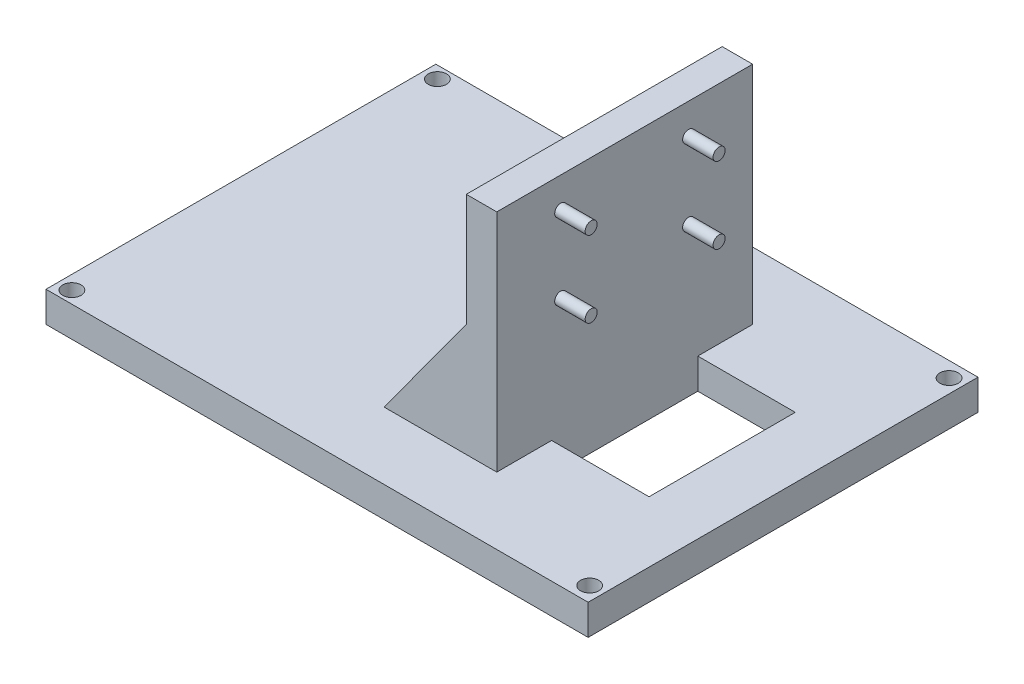
ISO-10303-21;
HEADER;
FILE_DESCRIPTION(('STEP AP214'),'2;1');
FILE_NAME('part.step','',(''),(''),'','','');
FILE_SCHEMA(('AUTOMOTIVE_DESIGN { 1 0 10303 214 1 1 1 1 }'));
ENDSEC;
DATA;
#1=APPLICATION_CONTEXT('core data for automotive mechanical design processes');
#2=APPLICATION_PROTOCOL_DEFINITION('international standard','automotive_design',2000,#1);
#3=PRODUCT_CONTEXT('',#1,'mechanical');
#4=PRODUCT('Part','Part','',(#3));
#5=PRODUCT_RELATED_PRODUCT_CATEGORY('part','',(#4));
#6=PRODUCT_DEFINITION_FORMATION('','',#4);
#7=PRODUCT_DEFINITION_CONTEXT('part definition',#1,'design');
#8=PRODUCT_DEFINITION('design','',#6,#7);
#9=PRODUCT_DEFINITION_SHAPE('','',#8);
#10=(LENGTH_UNIT() NAMED_UNIT(*) SI_UNIT(.MILLI.,.METRE.));
#11=(NAMED_UNIT(*) PLANE_ANGLE_UNIT() SI_UNIT($,.RADIAN.));
#12=(NAMED_UNIT(*) SI_UNIT($,.STERADIAN.) SOLID_ANGLE_UNIT());
#13=UNCERTAINTY_MEASURE_WITH_UNIT(LENGTH_MEASURE(1.E-05),#10,'distance_accuracy_value','');
#14=(GEOMETRIC_REPRESENTATION_CONTEXT(3) GLOBAL_UNCERTAINTY_ASSIGNED_CONTEXT((#13)) GLOBAL_UNIT_ASSIGNED_CONTEXT((#10,
#11,#12)) REPRESENTATION_CONTEXT('',''));
#15=CARTESIAN_POINT('',(0.,0.,0.));
#16=DIRECTION('',(0.,0.,1.));
#17=DIRECTION('',(1.,0.,0.));
#18=AXIS2_PLACEMENT_3D('',#15,#16,#17);
#19=CARTESIAN_POINT('',(0.,5.,0.));
#20=DIRECTION('',(0.,1.,0.));
#21=DIRECTION('',(0.,0.,1.));
#22=AXIS2_PLACEMENT_3D('',#19,#20,#21);
#23=PLANE('',#22);
#24=DIRECTION('',(-1.,0.,0.));
#25=VECTOR('',#24,1.);
#26=CARTESIAN_POINT('',(34.5,5.,12.));
#27=LINE('',#26,#25);
#28=CARTESIAN_POINT('',(34.5,5.,12.));
#29=VERTEX_POINT('',#28);
#30=CARTESIAN_POINT('',(18.5,5.,12.));
#31=VERTEX_POINT('',#30);
#32=EDGE_CURVE('E199',#29,#31,#27,.T.);
#33=ORIENTED_EDGE('',*,*,#32,.T.);
#34=DIRECTION('',(0.,0.,-1.));
#35=VECTOR('',#34,1.);
#36=CARTESIAN_POINT('',(18.5,5.,0.));
#37=LINE('',#36,#35);
#38=CARTESIAN_POINT('',(18.5,5.,21.));
#39=VERTEX_POINT('',#38);
#40=EDGE_CURVE('E56',#39,#31,#37,.T.);
#41=ORIENTED_EDGE('',*,*,#40,.F.);
#42=DIRECTION('',(1.,0.,0.));
#43=VECTOR('',#42,1.);
#44=CARTESIAN_POINT('',(0.,5.,21.));
#45=LINE('',#44,#43);
#46=CARTESIAN_POINT('',(0.,5.,21.));
#47=VERTEX_POINT('',#46);
#48=EDGE_CURVE('E191',#47,#39,#45,.T.);
#49=ORIENTED_EDGE('',*,*,#48,.F.);
#50=DIRECTION('',(0.,0.,-1.));
#51=VECTOR('',#50,1.);
#52=CARTESIAN_POINT('',(0.,5.,21.));
#53=LINE('',#52,#51);
#54=CARTESIAN_POINT('',(0.,5.,-21.));
#55=VERTEX_POINT('',#54);
#56=EDGE_CURVE('E159',#47,#55,#53,.T.);
#57=ORIENTED_EDGE('',*,*,#56,.T.);
#58=DIRECTION('',(1.,0.,0.));
#59=VECTOR('',#58,1.);
#60=CARTESIAN_POINT('',(0.,5.,-21.));
#61=LINE('',#60,#59);
#62=CARTESIAN_POINT('',(18.5,5.00000000000001,-21.));
#63=VERTEX_POINT('',#62);
#64=EDGE_CURVE('E193',#55,#63,#61,.T.);
#65=ORIENTED_EDGE('',*,*,#64,.T.);
#66=CARTESIAN_POINT('',(18.5,5.,-12.));
#67=VERTEX_POINT('',#66);
#68=EDGE_CURVE('E189',#67,#63,#37,.T.);
#69=ORIENTED_EDGE('',*,*,#68,.F.);
#70=DIRECTION('',(-1.,0.,0.));
#71=VECTOR('',#70,1.);
#72=CARTESIAN_POINT('',(34.5,5.,-12.));
#73=LINE('',#72,#71);
#74=CARTESIAN_POINT('',(34.5,5.,-12.));
#75=VERTEX_POINT('',#74);
#76=EDGE_CURVE('E48',#75,#67,#73,.T.);
#77=ORIENTED_EDGE('',*,*,#76,.F.);
#78=DIRECTION('',(0.,0.,1.));
#79=VECTOR('',#78,1.);
#80=CARTESIAN_POINT('',(34.5,5.,-12.));
#81=LINE('',#80,#79);
#82=EDGE_CURVE('E196',#75,#29,#81,.T.);
#83=ORIENTED_EDGE('',*,*,#82,.T.);
#84=EDGE_LOOP('',(#33,#41,#49,#57,#65,#69,#77,#83));
#85=FACE_BOUND('',#84,.T.);
#86=CARTESIAN_POINT('',(-42.25,5.,30.));
#87=DIRECTION('',(0.,1.,0.));
#88=DIRECTION('',(0.,0.,1.));
#89=AXIS2_PLACEMENT_3D('',#86,#87,#88);
#90=CIRCLE('',#89,1.5);
#91=CARTESIAN_POINT('',(-42.25,5.,31.5));
#92=VERTEX_POINT('',#91);
#93=EDGE_CURVE('E208',#92,#92,#90,.T.);
#94=ORIENTED_EDGE('',*,*,#93,.F.);
#95=EDGE_LOOP('',(#94));
#96=FACE_BOUND('',#95,.T.);
#97=CARTESIAN_POINT('',(-42.25,5.,-30.));
#98=DIRECTION('',(0.,1.,0.));
#99=DIRECTION('',(0.,0.,1.));
#100=AXIS2_PLACEMENT_3D('',#97,#98,#99);
#101=CIRCLE('',#100,1.5);
#102=CARTESIAN_POINT('',(-42.25,5.,-28.5));
#103=VERTEX_POINT('',#102);
#104=EDGE_CURVE('E211',#103,#103,#101,.T.);
#105=ORIENTED_EDGE('',*,*,#104,.F.);
#106=EDGE_LOOP('',(#105));
#107=FACE_BOUND('',#106,.T.);
#108=CARTESIAN_POINT('',(42.25,5.,-29.5));
#109=DIRECTION('',(0.,1.,0.));
#110=DIRECTION('',(0.,0.,1.));
#111=AXIS2_PLACEMENT_3D('',#108,#109,#110);
#112=CIRCLE('',#111,1.5);
#113=CARTESIAN_POINT('',(42.25,5.,-28.));
#114=VERTEX_POINT('',#113);
#115=EDGE_CURVE('E215',#114,#114,#112,.T.);
#116=ORIENTED_EDGE('',*,*,#115,.F.);
#117=EDGE_LOOP('',(#116));
#118=FACE_BOUND('',#117,.T.);
#119=CARTESIAN_POINT('',(42.25,5.,29.5));
#120=DIRECTION('',(0.,1.,0.));
#121=DIRECTION('',(0.,0.,1.));
#122=AXIS2_PLACEMENT_3D('',#119,#120,#121);
#123=CIRCLE('',#122,1.5);
#124=CARTESIAN_POINT('',(42.25,5.,31.));
#125=VERTEX_POINT('',#124);
#126=EDGE_CURVE('E218',#125,#125,#123,.T.);
#127=ORIENTED_EDGE('',*,*,#126,.F.);
#128=EDGE_LOOP('',(#127));
#129=FACE_BOUND('',#128,.T.);
#130=DIRECTION('',(0.,0.,-1.));
#131=VECTOR('',#130,1.);
#132=CARTESIAN_POINT('',(-44.5,5.,0.));
#133=LINE('',#132,#131);
#134=CARTESIAN_POINT('',(-44.5,5.,32.));
#135=VERTEX_POINT('',#134);
#136=CARTESIAN_POINT('',(-44.5,5.,-32.));
#137=VERTEX_POINT('',#136);
#138=EDGE_CURVE('E221',#135,#137,#133,.T.);
#139=ORIENTED_EDGE('',*,*,#138,.F.);
#140=DIRECTION('',(-1.,0.,0.));
#141=VECTOR('',#140,1.);
#142=CARTESIAN_POINT('',(0.,5.,32.));
#143=LINE('',#142,#141);
#144=CARTESIAN_POINT('',(44.5,5.,32.));
#145=VERTEX_POINT('',#144);
#146=EDGE_CURVE('E224',#145,#135,#143,.T.);
#147=ORIENTED_EDGE('',*,*,#146,.F.);
#148=DIRECTION('',(0.,0.,-1.));
#149=VECTOR('',#148,1.);
#150=CARTESIAN_POINT('',(44.5,5.,0.));
#151=LINE('',#150,#149);
#152=CARTESIAN_POINT('',(44.5,5.,-32.));
#153=VERTEX_POINT('',#152);
#154=EDGE_CURVE('E227',#145,#153,#151,.T.);
#155=ORIENTED_EDGE('',*,*,#154,.T.);
#156=DIRECTION('',(-1.,0.,0.));
#157=VECTOR('',#156,1.);
#158=CARTESIAN_POINT('',(0.,5.,-32.));
#159=LINE('',#158,#157);
#160=EDGE_CURVE('E230',#153,#137,#159,.T.);
#161=ORIENTED_EDGE('',*,*,#160,.T.);
#162=EDGE_LOOP('',(#139,#147,#155,#161));
#163=FACE_BOUND('',#162,.T.);
#164=ADVANCED_FACE('F33',(#85,#96,#107,#118,#129,#163),#23,.T.);
#165=CARTESIAN_POINT('',(13.5,42.,-21.));
#166=DIRECTION('',(1.,0.,0.));
#167=DIRECTION('',(0.,0.,-1.));
#168=AXIS2_PLACEMENT_3D('',#165,#166,#167);
#169=PLANE('',#168);
#170=DIRECTION('',(0.,0.,-1.));
#171=VECTOR('',#170,1.);
#172=CARTESIAN_POINT('',(13.5,23.5,21.));
#173=LINE('',#172,#171);
#174=CARTESIAN_POINT('',(13.5,23.5,21.));
#175=VERTEX_POINT('',#174);
#176=CARTESIAN_POINT('',(13.5,23.5,-21.));
#177=VERTEX_POINT('',#176);
#178=EDGE_CURVE('E164',#175,#177,#173,.T.);
#179=ORIENTED_EDGE('',*,*,#178,.F.);
#180=DIRECTION('',(0.,-1.,0.));
#181=VECTOR('',#180,1.);
#182=CARTESIAN_POINT('',(13.5,42.,21.));
#183=LINE('',#182,#181);
#184=CARTESIAN_POINT('',(13.5,42.,21.));
#185=VERTEX_POINT('',#184);
#186=EDGE_CURVE('E183',#185,#175,#183,.T.);
#187=ORIENTED_EDGE('',*,*,#186,.F.);
#188=DIRECTION('',(0.,0.,1.));
#189=VECTOR('',#188,1.);
#190=CARTESIAN_POINT('',(13.5,42.,-21.));
#191=LINE('',#190,#189);
#192=CARTESIAN_POINT('',(13.5,42.,-21.));
#193=VERTEX_POINT('',#192);
#194=EDGE_CURVE('E170',#193,#185,#191,.T.);
#195=ORIENTED_EDGE('',*,*,#194,.F.);
#196=DIRECTION('',(0.,-1.,0.));
#197=VECTOR('',#196,1.);
#198=CARTESIAN_POINT('',(13.5,42.,-21.));
#199=LINE('',#198,#197);
#200=EDGE_CURVE('E186',#193,#177,#199,.T.);
#201=ORIENTED_EDGE('',*,*,#200,.T.);
#202=EDGE_LOOP('',(#179,#187,#195,#201));
#203=FACE_BOUND('',#202,.T.);
#204=ADVANCED_FACE('F278',(#203),#169,.F.);
#205=CARTESIAN_POINT('',(-44.5,5.,0.));
#206=DIRECTION('',(-1.,0.,0.));
#207=DIRECTION('',(0.,0.,1.));
#208=AXIS2_PLACEMENT_3D('',#205,#206,#207);
#209=PLANE('',#208);
#210=DIRECTION('',(0.,0.,-1.));
#211=VECTOR('',#210,1.);
#212=CARTESIAN_POINT('',(-44.5,0.,0.));
#213=LINE('',#212,#211);
#214=CARTESIAN_POINT('',(-44.5,0.,32.));
#215=VERTEX_POINT('',#214);
#216=CARTESIAN_POINT('',(-44.5,0.,-32.));
#217=VERTEX_POINT('',#216);
#218=EDGE_CURVE('E244',#215,#217,#213,.T.);
#219=ORIENTED_EDGE('',*,*,#218,.F.);
#220=DIRECTION('',(0.,-1.,0.));
#221=VECTOR('',#220,1.);
#222=CARTESIAN_POINT('',(-44.5,5.,32.));
#223=LINE('',#222,#221);
#224=EDGE_CURVE('E11',#135,#215,#223,.T.);
#225=ORIENTED_EDGE('',*,*,#224,.F.);
#226=ORIENTED_EDGE('',*,*,#138,.T.);
#227=DIRECTION('',(0.,-1.,0.));
#228=VECTOR('',#227,1.);
#229=CARTESIAN_POINT('',(-44.5,5.,-32.));
#230=LINE('',#229,#228);
#231=EDGE_CURVE('E232',#137,#217,#230,.T.);
#232=ORIENTED_EDGE('',*,*,#231,.T.);
#233=EDGE_LOOP('',(#219,#225,#226,#232));
#234=FACE_BOUND('',#233,.T.);
#235=ADVANCED_FACE('F272',(#234),#209,.T.);
#236=CARTESIAN_POINT('',(0.,5.,32.));
#237=DIRECTION('',(0.,0.,1.));
#238=DIRECTION('',(1.,0.,0.));
#239=AXIS2_PLACEMENT_3D('',#236,#237,#238);
#240=PLANE('',#239);
#241=DIRECTION('',(-1.,0.,0.));
#242=VECTOR('',#241,1.);
#243=CARTESIAN_POINT('',(0.,0.,32.));
#244=LINE('',#243,#242);
#245=CARTESIAN_POINT('',(44.5,0.,32.));
#246=VERTEX_POINT('',#245);
#247=EDGE_CURVE('E247',#246,#215,#244,.T.);
#248=ORIENTED_EDGE('',*,*,#247,.F.);
#249=DIRECTION('',(0.,-1.,0.));
#250=VECTOR('',#249,1.);
#251=CARTESIAN_POINT('',(44.5,5.,32.));
#252=LINE('',#251,#250);
#253=EDGE_CURVE('E41',#145,#246,#252,.T.);
#254=ORIENTED_EDGE('',*,*,#253,.F.);
#255=ORIENTED_EDGE('',*,*,#146,.T.);
#256=ORIENTED_EDGE('',*,*,#224,.T.);
#257=EDGE_LOOP('',(#248,#254,#255,#256));
#258=FACE_BOUND('',#257,.T.);
#259=ADVANCED_FACE('F268',(#258),#240,.T.);
#260=CARTESIAN_POINT('',(44.5,5.,0.));
#261=DIRECTION('',(-1.,0.,0.));
#262=DIRECTION('',(0.,0.,1.));
#263=AXIS2_PLACEMENT_3D('',#260,#261,#262);
#264=PLANE('',#263);
#265=DIRECTION('',(0.,0.,-1.));
#266=VECTOR('',#265,1.);
#267=CARTESIAN_POINT('',(44.5,0.,0.));
#268=LINE('',#267,#266);
#269=CARTESIAN_POINT('',(44.5,0.,-32.));
#270=VERTEX_POINT('',#269);
#271=EDGE_CURVE('E250',#246,#270,#268,.T.);
#272=ORIENTED_EDGE('',*,*,#271,.T.);
#273=DIRECTION('',(0.,-1.,0.));
#274=VECTOR('',#273,1.);
#275=CARTESIAN_POINT('',(44.5,5.,-32.));
#276=LINE('',#275,#274);
#277=EDGE_CURVE('E256',#153,#270,#276,.T.);
#278=ORIENTED_EDGE('',*,*,#277,.F.);
#279=ORIENTED_EDGE('',*,*,#154,.F.);
#280=ORIENTED_EDGE('',*,*,#253,.T.);
#281=EDGE_LOOP('',(#272,#278,#279,#280));
#282=FACE_BOUND('',#281,.T.);
#283=ADVANCED_FACE('F261',(#282),#264,.F.);
#284=CARTESIAN_POINT('',(42.25,5.,29.5));
#285=DIRECTION('',(0.,-1.,0.));
#286=DIRECTION('',(0.,0.,-1.));
#287=AXIS2_PLACEMENT_3D('',#284,#285,#286);
#288=CYLINDRICAL_SURFACE('',#287,1.5);
#289=ORIENTED_EDGE('',*,*,#126,.T.);
#290=EDGE_LOOP('',(#289));
#291=FACE_BOUND('',#290,.T.);
#292=CARTESIAN_POINT('',(42.25,0.,29.5));
#293=DIRECTION('',(0.,1.,0.));
#294=DIRECTION('',(0.,0.,1.));
#295=AXIS2_PLACEMENT_3D('',#292,#293,#294);
#296=CIRCLE('',#295,1.5);
#297=CARTESIAN_POINT('',(42.25,0.,31.));
#298=VERTEX_POINT('',#297);
#299=EDGE_CURVE('E241',#298,#298,#296,.T.);
#300=ORIENTED_EDGE('',*,*,#299,.F.);
#301=EDGE_LOOP('',(#300));
#302=FACE_BOUND('',#301,.T.);
#303=ADVANCED_FACE('F296',(#291,#302),#288,.F.);
#304=CARTESIAN_POINT('',(42.25,5.,-29.5));
#305=DIRECTION('',(0.,-1.,0.));
#306=DIRECTION('',(0.,0.,-1.));
#307=AXIS2_PLACEMENT_3D('',#304,#305,#306);
#308=CYLINDRICAL_SURFACE('',#307,1.5);
#309=ORIENTED_EDGE('',*,*,#115,.T.);
#310=EDGE_LOOP('',(#309));
#311=FACE_BOUND('',#310,.T.);
#312=CARTESIAN_POINT('',(42.25,0.,-29.5));
#313=DIRECTION('',(0.,1.,0.));
#314=DIRECTION('',(0.,0.,1.));
#315=AXIS2_PLACEMENT_3D('',#312,#313,#314);
#316=CIRCLE('',#315,1.5);
#317=CARTESIAN_POINT('',(42.25,0.,-28.));
#318=VERTEX_POINT('',#317);
#319=EDGE_CURVE('E238',#318,#318,#316,.T.);
#320=ORIENTED_EDGE('',*,*,#319,.F.);
#321=EDGE_LOOP('',(#320));
#322=FACE_BOUND('',#321,.T.);
#323=ADVANCED_FACE('F303',(#311,#322),#308,.F.);
#324=CARTESIAN_POINT('',(-42.25,5.,-30.));
#325=DIRECTION('',(0.,-1.,0.));
#326=DIRECTION('',(0.,0.,-1.));
#327=AXIS2_PLACEMENT_3D('',#324,#325,#326);
#328=CYLINDRICAL_SURFACE('',#327,1.5);
#329=ORIENTED_EDGE('',*,*,#104,.T.);
#330=EDGE_LOOP('',(#329));
#331=FACE_BOUND('',#330,.T.);
#332=CARTESIAN_POINT('',(-42.25,0.,-30.));
#333=DIRECTION('',(0.,1.,0.));
#334=DIRECTION('',(0.,0.,1.));
#335=AXIS2_PLACEMENT_3D('',#332,#333,#334);
#336=CIRCLE('',#335,1.5);
#337=CARTESIAN_POINT('',(-42.25,0.,-28.5));
#338=VERTEX_POINT('',#337);
#339=EDGE_CURVE('E235',#338,#338,#336,.T.);
#340=ORIENTED_EDGE('',*,*,#339,.F.);
#341=EDGE_LOOP('',(#340));
#342=FACE_BOUND('',#341,.T.);
#343=ADVANCED_FACE('F306',(#331,#342),#328,.F.);
#344=CARTESIAN_POINT('',(-42.25,5.,30.));
#345=DIRECTION('',(0.,-1.,0.));
#346=DIRECTION('',(0.,0.,-1.));
#347=AXIS2_PLACEMENT_3D('',#344,#345,#346);
#348=CYLINDRICAL_SURFACE('',#347,1.5);
#349=ORIENTED_EDGE('',*,*,#93,.T.);
#350=EDGE_LOOP('',(#349));
#351=FACE_BOUND('',#350,.T.);
#352=CARTESIAN_POINT('',(-42.25,0.,30.));
#353=DIRECTION('',(0.,1.,0.));
#354=DIRECTION('',(0.,0.,1.));
#355=AXIS2_PLACEMENT_3D('',#352,#353,#354);
#356=CIRCLE('',#355,1.5);
#357=CARTESIAN_POINT('',(-42.25,0.,31.5));
#358=VERTEX_POINT('',#357);
#359=EDGE_CURVE('E206',#358,#358,#356,.T.);
#360=ORIENTED_EDGE('',*,*,#359,.F.);
#361=EDGE_LOOP('',(#360));
#362=FACE_BOUND('',#361,.T.);
#363=ADVANCED_FACE('F35',(#351,#362),#348,.F.);
#364=CARTESIAN_POINT('',(0.,5.,-32.));
#365=DIRECTION('',(0.,0.,1.));
#366=DIRECTION('',(1.,0.,0.));
#367=AXIS2_PLACEMENT_3D('',#364,#365,#366);
#368=PLANE('',#367);
#369=DIRECTION('',(-1.,0.,0.));
#370=VECTOR('',#369,1.);
#371=CARTESIAN_POINT('',(0.,0.,-32.));
#372=LINE('',#371,#370);
#373=EDGE_CURVE('E212',#270,#217,#372,.T.);
#374=ORIENTED_EDGE('',*,*,#373,.T.);
#375=ORIENTED_EDGE('',*,*,#231,.F.);
#376=ORIENTED_EDGE('',*,*,#160,.F.);
#377=ORIENTED_EDGE('',*,*,#277,.T.);
#378=EDGE_LOOP('',(#374,#375,#376,#377));
#379=FACE_BOUND('',#378,.T.);
#380=ADVANCED_FACE('F275',(#379),#368,.F.);
#381=CARTESIAN_POINT('',(0.,0.,0.));
#382=DIRECTION('',(0.,1.,0.));
#383=DIRECTION('',(0.,0.,1.));
#384=AXIS2_PLACEMENT_3D('',#381,#382,#383);
#385=PLANE('',#384);
#386=ORIENTED_EDGE('',*,*,#218,.T.);
#387=ORIENTED_EDGE('',*,*,#373,.F.);
#388=ORIENTED_EDGE('',*,*,#271,.F.);
#389=ORIENTED_EDGE('',*,*,#247,.T.);
#390=EDGE_LOOP('',(#386,#387,#388,#389));
#391=FACE_BOUND('',#390,.T.);
#392=ORIENTED_EDGE('',*,*,#299,.T.);
#393=EDGE_LOOP('',(#392));
#394=FACE_BOUND('',#393,.T.);
#395=ORIENTED_EDGE('',*,*,#319,.T.);
#396=EDGE_LOOP('',(#395));
#397=FACE_BOUND('',#396,.T.);
#398=ORIENTED_EDGE('',*,*,#339,.T.);
#399=EDGE_LOOP('',(#398));
#400=FACE_BOUND('',#399,.T.);
#401=ORIENTED_EDGE('',*,*,#359,.T.);
#402=EDGE_LOOP('',(#401));
#403=FACE_BOUND('',#402,.T.);
#404=DIRECTION('',(0.,0.,-1.));
#405=VECTOR('',#404,1.);
#406=CARTESIAN_POINT('',(18.5,0.,12.));
#407=LINE('',#406,#405);
#408=CARTESIAN_POINT('',(18.5,0.,12.));
#409=VERTEX_POINT('',#408);
#410=CARTESIAN_POINT('',(18.5,0.,-12.));
#411=VERTEX_POINT('',#410);
#412=EDGE_CURVE('E145',#409,#411,#407,.T.);
#413=ORIENTED_EDGE('',*,*,#412,.F.);
#414=DIRECTION('',(-1.,0.,0.));
#415=VECTOR('',#414,1.);
#416=CARTESIAN_POINT('',(34.5,0.,12.));
#417=LINE('',#416,#415);
#418=CARTESIAN_POINT('',(34.5,0.,12.));
#419=VERTEX_POINT('',#418);
#420=EDGE_CURVE('E129',#419,#409,#417,.T.);
#421=ORIENTED_EDGE('',*,*,#420,.F.);
#422=DIRECTION('',(0.,0.,1.));
#423=VECTOR('',#422,1.);
#424=CARTESIAN_POINT('',(34.5,0.,-12.));
#425=LINE('',#424,#423);
#426=CARTESIAN_POINT('',(34.5,0.,-12.));
#427=VERTEX_POINT('',#426);
#428=EDGE_CURVE('E139',#427,#419,#425,.T.);
#429=ORIENTED_EDGE('',*,*,#428,.F.);
#430=DIRECTION('',(-1.,0.,0.));
#431=VECTOR('',#430,1.);
#432=CARTESIAN_POINT('',(34.5,0.,-12.));
#433=LINE('',#432,#431);
#434=EDGE_CURVE('E138',#427,#411,#433,.T.);
#435=ORIENTED_EDGE('',*,*,#434,.T.);
#436=EDGE_LOOP('',(#413,#421,#429,#435));
#437=FACE_BOUND('',#436,.T.);
#438=ADVANCED_FACE('F148',(#391,#394,#397,#400,#403,#437),#385,.F.);
#439=CARTESIAN_POINT('',(34.5,5.,-12.));
#440=DIRECTION('',(1.,0.,0.));
#441=DIRECTION('',(0.,0.,-1.));
#442=AXIS2_PLACEMENT_3D('',#439,#440,#441);
#443=PLANE('',#442);
#444=ORIENTED_EDGE('',*,*,#428,.T.);
#445=DIRECTION('',(0.,-1.,0.));
#446=VECTOR('',#445,1.);
#447=CARTESIAN_POINT('',(34.5,5.,12.));
#448=LINE('',#447,#446);
#449=EDGE_CURVE('E134',#29,#419,#448,.T.);
#450=ORIENTED_EDGE('',*,*,#449,.F.);
#451=ORIENTED_EDGE('',*,*,#82,.F.);
#452=DIRECTION('',(0.,-1.,0.));
#453=VECTOR('',#452,1.);
#454=CARTESIAN_POINT('',(34.5,5.,-12.));
#455=LINE('',#454,#453);
#456=EDGE_CURVE('E204',#75,#427,#455,.T.);
#457=ORIENTED_EDGE('',*,*,#456,.T.);
#458=EDGE_LOOP('',(#444,#450,#451,#457));
#459=FACE_BOUND('',#458,.T.);
#460=ADVANCED_FACE('F288',(#459),#443,.F.);
#461=CARTESIAN_POINT('',(34.5,5.,-12.));
#462=DIRECTION('',(0.,0.,1.));
#463=DIRECTION('',(1.,0.,0.));
#464=AXIS2_PLACEMENT_3D('',#461,#462,#463);
#465=PLANE('',#464);
#466=ORIENTED_EDGE('',*,*,#434,.F.);
#467=ORIENTED_EDGE('',*,*,#456,.F.);
#468=ORIENTED_EDGE('',*,*,#76,.T.);
#469=DIRECTION('',(0.,1.,0.));
#470=VECTOR('',#469,1.);
#471=CARTESIAN_POINT('',(18.5,5.,-12.));
#472=LINE('',#471,#470);
#473=EDGE_CURVE('E150',#411,#67,#472,.T.);
#474=ORIENTED_EDGE('',*,*,#473,.F.);
#475=EDGE_LOOP('',(#466,#467,#468,#474));
#476=FACE_BOUND('',#475,.T.);
#477=ADVANCED_FACE('F349',(#476),#465,.T.);
#478=CARTESIAN_POINT('',(34.5,5.,12.));
#479=DIRECTION('',(0.,0.,1.));
#480=DIRECTION('',(1.,0.,0.));
#481=AXIS2_PLACEMENT_3D('',#478,#479,#480);
#482=PLANE('',#481);
#483=ORIENTED_EDGE('',*,*,#420,.T.);
#484=DIRECTION('',(0.,-1.,0.));
#485=VECTOR('',#484,1.);
#486=CARTESIAN_POINT('',(18.5,5.,12.));
#487=LINE('',#486,#485);
#488=EDGE_CURVE('E133',#31,#409,#487,.T.);
#489=ORIENTED_EDGE('',*,*,#488,.F.);
#490=ORIENTED_EDGE('',*,*,#32,.F.);
#491=ORIENTED_EDGE('',*,*,#449,.T.);
#492=EDGE_LOOP('',(#483,#489,#490,#491));
#493=FACE_BOUND('',#492,.T.);
#494=ADVANCED_FACE('F131',(#493),#482,.F.);
#495=CARTESIAN_POINT('',(18.5,42.,-21.));
#496=DIRECTION('',(0.,0.,1.));
#497=DIRECTION('',(1.,0.,0.));
#498=AXIS2_PLACEMENT_3D('',#495,#496,#497);
#499=PLANE('',#498);
#500=ORIENTED_EDGE('',*,*,#64,.F.);
#501=DIRECTION('',(-0.589469070059423,-0.807790947859209,0.));
#502=VECTOR('',#501,1.);
#503=CARTESIAN_POINT('',(13.5,23.5,-21.));
#504=LINE('',#503,#502);
#505=EDGE_CURVE('E152',#177,#55,#504,.T.);
#506=ORIENTED_EDGE('',*,*,#505,.F.);
#507=ORIENTED_EDGE('',*,*,#200,.F.);
#508=DIRECTION('',(-1.,0.,0.));
#509=VECTOR('',#508,1.);
#510=CARTESIAN_POINT('',(18.5,42.,-21.));
#511=LINE('',#510,#509);
#512=CARTESIAN_POINT('',(18.5,42.,-21.));
#513=VERTEX_POINT('',#512);
#514=EDGE_CURVE('E167',#513,#193,#511,.T.);
#515=ORIENTED_EDGE('',*,*,#514,.F.);
#516=DIRECTION('',(0.,-1.,0.));
#517=VECTOR('',#516,1.);
#518=CARTESIAN_POINT('',(18.5,42.,-21.));
#519=LINE('',#518,#517);
#520=EDGE_CURVE('E178',#513,#63,#519,.T.);
#521=ORIENTED_EDGE('',*,*,#520,.T.);
#522=EDGE_LOOP('',(#500,#506,#507,#515,#521));
#523=FACE_BOUND('',#522,.T.);
#524=ADVANCED_FACE('F362',(#523),#499,.F.);
#525=CARTESIAN_POINT('',(18.5,42.,21.));
#526=DIRECTION('',(0.,0.,1.));
#527=DIRECTION('',(1.,0.,0.));
#528=AXIS2_PLACEMENT_3D('',#525,#526,#527);
#529=PLANE('',#528);
#530=ORIENTED_EDGE('',*,*,#186,.T.);
#531=DIRECTION('',(-0.589469070059423,-0.807790947859209,0.));
#532=VECTOR('',#531,1.);
#533=CARTESIAN_POINT('',(13.5,23.5,21.));
#534=LINE('',#533,#532);
#535=EDGE_CURVE('E156',#175,#47,#534,.T.);
#536=ORIENTED_EDGE('',*,*,#535,.T.);
#537=ORIENTED_EDGE('',*,*,#48,.T.);
#538=DIRECTION('',(0.,-1.,0.));
#539=VECTOR('',#538,1.);
#540=CARTESIAN_POINT('',(18.5,42.,21.));
#541=LINE('',#540,#539);
#542=CARTESIAN_POINT('',(18.5,42.,21.));
#543=VERTEX_POINT('',#542);
#544=EDGE_CURVE('E181',#543,#39,#541,.T.);
#545=ORIENTED_EDGE('',*,*,#544,.F.);
#546=DIRECTION('',(-1.,0.,0.));
#547=VECTOR('',#546,1.);
#548=CARTESIAN_POINT('',(18.5,42.,21.));
#549=LINE('',#548,#547);
#550=EDGE_CURVE('E172',#543,#185,#549,.T.);
#551=ORIENTED_EDGE('',*,*,#550,.T.);
#552=EDGE_LOOP('',(#530,#536,#537,#545,#551));
#553=FACE_BOUND('',#552,.T.);
#554=ADVANCED_FACE('F369',(#553),#529,.T.);
#555=CARTESIAN_POINT('',(18.5,42.,-21.));
#556=DIRECTION('',(1.,0.,0.));
#557=DIRECTION('',(0.,0.,-1.));
#558=AXIS2_PLACEMENT_3D('',#555,#556,#557);
#559=PLANE('',#558);
#560=CARTESIAN_POINT('',(18.5,24.5,10.4999999999999));
#561=DIRECTION('',(1.,0.,0.));
#562=DIRECTION('',(0.,0.,-1.));
#563=AXIS2_PLACEMENT_3D('',#560,#561,#562);
#564=CIRCLE('',#563,0.989999999999999);
#565=CARTESIAN_POINT('',(18.5,24.5,9.50999999999988));
#566=VERTEX_POINT('',#565);
#567=EDGE_CURVE('E569',#566,#566,#564,.T.);
#568=ORIENTED_EDGE('',*,*,#567,.F.);
#569=EDGE_LOOP('',(#568));
#570=FACE_BOUND('',#569,.T.);
#571=CARTESIAN_POINT('',(18.5,24.5000000000002,-10.5000000000001));
#572=DIRECTION('',(1.,0.,0.));
#573=DIRECTION('',(0.,0.,-1.));
#574=AXIS2_PLACEMENT_3D('',#571,#572,#573);
#575=CIRCLE('',#574,0.989999999999999);
#576=CARTESIAN_POINT('',(18.5,24.5000000000002,-11.4900000000001));
#577=VERTEX_POINT('',#576);
#578=EDGE_CURVE('E568',#577,#577,#575,.T.);
#579=ORIENTED_EDGE('',*,*,#578,.F.);
#580=EDGE_LOOP('',(#579));
#581=FACE_BOUND('',#580,.T.);
#582=CARTESIAN_POINT('',(18.5,37.,-10.5));
#583=DIRECTION('',(1.,0.,0.));
#584=DIRECTION('',(0.,0.,-1.));
#585=AXIS2_PLACEMENT_3D('',#582,#583,#584);
#586=CIRCLE('',#585,0.989999999999999);
#587=CARTESIAN_POINT('',(18.5,37.,-11.49));
#588=VERTEX_POINT('',#587);
#589=EDGE_CURVE('E578',#588,#588,#586,.T.);
#590=ORIENTED_EDGE('',*,*,#589,.F.);
#591=EDGE_LOOP('',(#590));
#592=FACE_BOUND('',#591,.T.);
#593=CARTESIAN_POINT('',(18.5,37.,10.4999999999999));
#594=DIRECTION('',(1.,0.,0.));
#595=DIRECTION('',(0.,0.,-1.));
#596=AXIS2_PLACEMENT_3D('',#593,#594,#595);
#597=CIRCLE('',#596,0.990000000000003);
#598=CARTESIAN_POINT('',(18.5,37.,9.50999999999994));
#599=VERTEX_POINT('',#598);
#600=EDGE_CURVE('E583',#599,#599,#597,.T.);
#601=ORIENTED_EDGE('',*,*,#600,.F.);
#602=EDGE_LOOP('',(#601));
#603=FACE_BOUND('',#602,.T.);
#604=ORIENTED_EDGE('',*,*,#544,.T.);
#605=ORIENTED_EDGE('',*,*,#40,.T.);
#606=ORIENTED_EDGE('',*,*,#488,.T.);
#607=ORIENTED_EDGE('',*,*,#412,.T.);
#608=ORIENTED_EDGE('',*,*,#473,.T.);
#609=ORIENTED_EDGE('',*,*,#68,.T.);
#610=ORIENTED_EDGE('',*,*,#520,.F.);
#611=DIRECTION('',(0.,0.,1.));
#612=VECTOR('',#611,1.);
#613=CARTESIAN_POINT('',(18.5,42.,-21.));
#614=LINE('',#613,#612);
#615=EDGE_CURVE('E175',#513,#543,#614,.T.);
#616=ORIENTED_EDGE('',*,*,#615,.T.);
#617=EDGE_LOOP('',(#604,#605,#606,#607,#608,#609,#610,#616));
#618=FACE_BOUND('',#617,.T.);
#619=ADVANCED_FACE('F144',(#570,#581,#592,#603,#618),#559,.T.);
#620=CARTESIAN_POINT('',(0.,42.,0.));
#621=DIRECTION('',(0.,1.,0.));
#622=DIRECTION('',(0.,0.,1.));
#623=AXIS2_PLACEMENT_3D('',#620,#621,#622);
#624=PLANE('',#623);
#625=ORIENTED_EDGE('',*,*,#514,.T.);
#626=ORIENTED_EDGE('',*,*,#194,.T.);
#627=ORIENTED_EDGE('',*,*,#550,.F.);
#628=ORIENTED_EDGE('',*,*,#615,.F.);
#629=EDGE_LOOP('',(#625,#626,#627,#628));
#630=FACE_BOUND('',#629,.T.);
#631=ADVANCED_FACE('F385',(#630),#624,.T.);
#632=CARTESIAN_POINT('',(13.5,23.5,21.));
#633=DIRECTION('',(0.807790947859209,-0.589469070059423,0.));
#634=DIRECTION('',(0.589469070059423,0.807790947859209,0.));
#635=AXIS2_PLACEMENT_3D('',#632,#633,#634);
#636=PLANE('',#635);
#637=ORIENTED_EDGE('',*,*,#505,.T.);
#638=ORIENTED_EDGE('',*,*,#56,.F.);
#639=ORIENTED_EDGE('',*,*,#535,.F.);
#640=ORIENTED_EDGE('',*,*,#178,.T.);
#641=EDGE_LOOP('',(#637,#638,#639,#640));
#642=FACE_BOUND('',#641,.T.);
#643=ADVANCED_FACE('F393',(#642),#636,.F.);
#644=CARTESIAN_POINT('',(23.5,37.,10.4999999999999));
#645=DIRECTION('',(-1.,0.,0.));
#646=DIRECTION('',(0.,0.,1.));
#647=AXIS2_PLACEMENT_3D('',#644,#645,#646);
#648=CYLINDRICAL_SURFACE('',#647,0.990000000000003);
#649=CARTESIAN_POINT('',(23.5,37.,10.4999999999999));
#650=DIRECTION('',(1.,0.,0.));
#651=DIRECTION('',(0.,0.,-1.));
#652=AXIS2_PLACEMENT_3D('',#649,#650,#651);
#653=CIRCLE('',#652,0.990000000000003);
#654=CARTESIAN_POINT('',(23.5,37.,9.50999999999994));
#655=VERTEX_POINT('',#654);
#656=EDGE_CURVE('E146',#655,#655,#653,.T.);
#657=ORIENTED_EDGE('',*,*,#656,.F.);
#658=EDGE_LOOP('',(#657));
#659=FACE_BOUND('',#658,.T.);
#660=ORIENTED_EDGE('',*,*,#600,.T.);
#661=EDGE_LOOP('',(#660));
#662=FACE_BOUND('',#661,.T.);
#663=ADVANCED_FACE('F400',(#659,#662),#648,.T.);
#664=CARTESIAN_POINT('',(23.5,37.,10.4999999999999));
#665=DIRECTION('',(1.,0.,0.));
#666=DIRECTION('',(0.,0.,-1.));
#667=AXIS2_PLACEMENT_3D('',#664,#665,#666);
#668=PLANE('',#667);
#669=ORIENTED_EDGE('',*,*,#656,.T.);
#670=EDGE_LOOP('',(#669));
#671=FACE_BOUND('',#670,.T.);
#672=ADVANCED_FACE('F407',(#671),#668,.T.);
#673=CARTESIAN_POINT('',(23.5,37.,-10.5));
#674=DIRECTION('',(-1.,0.,0.));
#675=DIRECTION('',(0.,0.,1.));
#676=AXIS2_PLACEMENT_3D('',#673,#674,#675);
#677=CYLINDRICAL_SURFACE('',#676,0.989999999999999);
#678=CARTESIAN_POINT('',(23.5,37.,-10.5));
#679=DIRECTION('',(1.,0.,0.));
#680=DIRECTION('',(0.,0.,-1.));
#681=AXIS2_PLACEMENT_3D('',#678,#679,#680);
#682=CIRCLE('',#681,0.989999999999999);
#683=CARTESIAN_POINT('',(23.5,37.,-11.49));
#684=VERTEX_POINT('',#683);
#685=EDGE_CURVE('E580',#684,#684,#682,.T.);
#686=ORIENTED_EDGE('',*,*,#685,.F.);
#687=EDGE_LOOP('',(#686));
#688=FACE_BOUND('',#687,.T.);
#689=ORIENTED_EDGE('',*,*,#589,.T.);
#690=EDGE_LOOP('',(#689));
#691=FACE_BOUND('',#690,.T.);
#692=ADVANCED_FACE('F415',(#688,#691),#677,.T.);
#693=CARTESIAN_POINT('',(23.5,37.,-10.5));
#694=DIRECTION('',(1.,0.,0.));
#695=DIRECTION('',(0.,0.,-1.));
#696=AXIS2_PLACEMENT_3D('',#693,#694,#695);
#697=PLANE('',#696);
#698=ORIENTED_EDGE('',*,*,#685,.T.);
#699=EDGE_LOOP('',(#698));
#700=FACE_BOUND('',#699,.T.);
#701=ADVANCED_FACE('F423',(#700),#697,.T.);
#702=CARTESIAN_POINT('',(23.5,24.5000000000002,-10.5000000000001));
#703=DIRECTION('',(-1.,0.,0.));
#704=DIRECTION('',(0.,0.,1.));
#705=AXIS2_PLACEMENT_3D('',#702,#703,#704);
#706=CYLINDRICAL_SURFACE('',#705,0.989999999999999);
#707=CARTESIAN_POINT('',(23.5,24.5000000000002,-10.5000000000001));
#708=DIRECTION('',(1.,0.,0.));
#709=DIRECTION('',(0.,0.,-1.));
#710=AXIS2_PLACEMENT_3D('',#707,#708,#709);
#711=CIRCLE('',#710,0.989999999999999);
#712=CARTESIAN_POINT('',(23.5,24.5000000000002,-11.4900000000001));
#713=VERTEX_POINT('',#712);
#714=EDGE_CURVE('E572',#713,#713,#711,.T.);
#715=ORIENTED_EDGE('',*,*,#714,.F.);
#716=EDGE_LOOP('',(#715));
#717=FACE_BOUND('',#716,.T.);
#718=ORIENTED_EDGE('',*,*,#578,.T.);
#719=EDGE_LOOP('',(#718));
#720=FACE_BOUND('',#719,.T.);
#721=ADVANCED_FACE('F431',(#717,#720),#706,.T.);
#722=CARTESIAN_POINT('',(23.5,24.5000000000002,-10.5000000000001));
#723=DIRECTION('',(1.,0.,0.));
#724=DIRECTION('',(0.,0.,-1.));
#725=AXIS2_PLACEMENT_3D('',#722,#723,#724);
#726=PLANE('',#725);
#727=ORIENTED_EDGE('',*,*,#714,.T.);
#728=EDGE_LOOP('',(#727));
#729=FACE_BOUND('',#728,.T.);
#730=ADVANCED_FACE('F439',(#729),#726,.T.);
#731=CARTESIAN_POINT('',(23.5,24.5,10.4999999999999));
#732=DIRECTION('',(-1.,0.,0.));
#733=DIRECTION('',(0.,0.,1.));
#734=AXIS2_PLACEMENT_3D('',#731,#732,#733);
#735=CYLINDRICAL_SURFACE('',#734,0.989999999999999);
#736=CARTESIAN_POINT('',(23.5,24.5,10.4999999999999));
#737=DIRECTION('',(1.,0.,0.));
#738=DIRECTION('',(0.,0.,-1.));
#739=AXIS2_PLACEMENT_3D('',#736,#737,#738);
#740=CIRCLE('',#739,0.989999999999999);
#741=CARTESIAN_POINT('',(23.5,24.5,9.50999999999988));
#742=VERTEX_POINT('',#741);
#743=EDGE_CURVE('E567',#742,#742,#740,.T.);
#744=ORIENTED_EDGE('',*,*,#743,.F.);
#745=EDGE_LOOP('',(#744));
#746=FACE_BOUND('',#745,.T.);
#747=ORIENTED_EDGE('',*,*,#567,.T.);
#748=EDGE_LOOP('',(#747));
#749=FACE_BOUND('',#748,.T.);
#750=ADVANCED_FACE('F447',(#746,#749),#735,.T.);
#751=CARTESIAN_POINT('',(23.5,24.5,10.4999999999999));
#752=DIRECTION('',(1.,0.,0.));
#753=DIRECTION('',(0.,0.,-1.));
#754=AXIS2_PLACEMENT_3D('',#751,#752,#753);
#755=PLANE('',#754);
#756=ORIENTED_EDGE('',*,*,#743,.T.);
#757=EDGE_LOOP('',(#756));
#758=FACE_BOUND('',#757,.T.);
#759=ADVANCED_FACE('F455',(#758),#755,.T.);
#760=CLOSED_SHELL('',(#164,#204,#235,#259,#283,#303,#323,#343,#363,#380,#438,#460,#477,#494,
#524,#554,#619,#631,#643,#663,#672,#692,#701,#721,#730,#750,#759));
#761=MANIFOLD_SOLID_BREP('B2',#760);
#762=ADVANCED_BREP_SHAPE_REPRESENTATION('',(#18,#761),#14);
#763=SHAPE_DEFINITION_REPRESENTATION(#9,#762);
ENDSEC;
END-ISO-10303-21;
